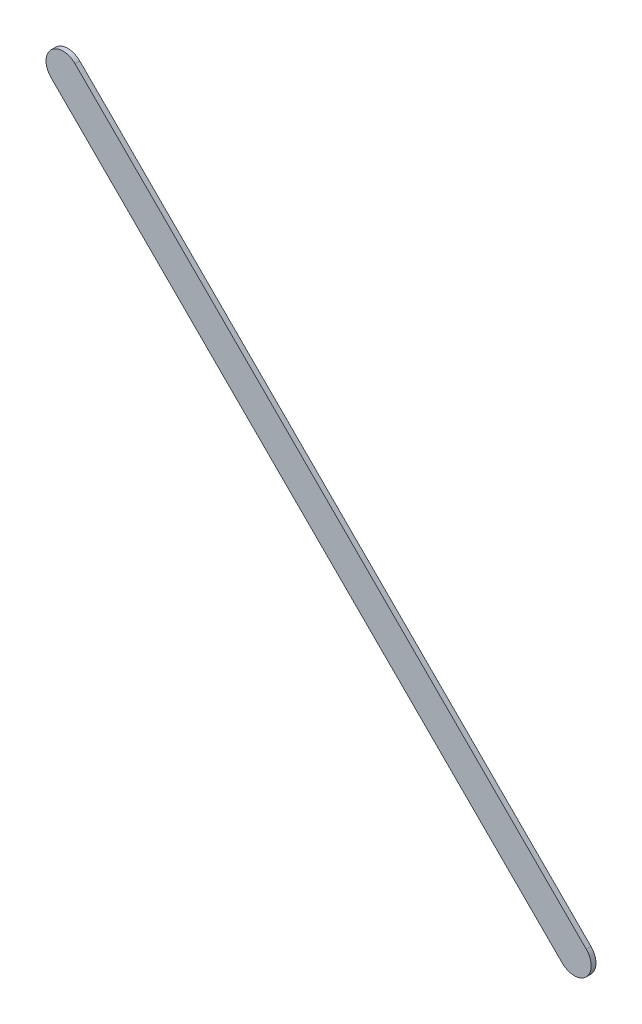
ISO-10303-21;
HEADER;
FILE_DESCRIPTION(('STEP AP214'),'2;1');
FILE_NAME('part.step','',(''),(''),'','','');
FILE_SCHEMA(('AUTOMOTIVE_DESIGN { 1 0 10303 214 1 1 1 1 }'));
ENDSEC;
DATA;
#1=APPLICATION_CONTEXT('core data for automotive mechanical design processes');
#2=APPLICATION_PROTOCOL_DEFINITION('international standard','automotive_design',2000,#1);
#3=PRODUCT_CONTEXT('',#1,'mechanical');
#4=PRODUCT('Part','Part','',(#3));
#5=PRODUCT_RELATED_PRODUCT_CATEGORY('part','',(#4));
#6=PRODUCT_DEFINITION_FORMATION('','',#4);
#7=PRODUCT_DEFINITION_CONTEXT('part definition',#1,'design');
#8=PRODUCT_DEFINITION('design','',#6,#7);
#9=PRODUCT_DEFINITION_SHAPE('','',#8);
#10=(LENGTH_UNIT() NAMED_UNIT(*) SI_UNIT(.MILLI.,.METRE.));
#11=(NAMED_UNIT(*) PLANE_ANGLE_UNIT() SI_UNIT($,.RADIAN.));
#12=(NAMED_UNIT(*) SI_UNIT($,.STERADIAN.) SOLID_ANGLE_UNIT());
#13=UNCERTAINTY_MEASURE_WITH_UNIT(LENGTH_MEASURE(1.E-05),#10,'distance_accuracy_value','');
#14=(GEOMETRIC_REPRESENTATION_CONTEXT(3) GLOBAL_UNCERTAINTY_ASSIGNED_CONTEXT((#13)) GLOBAL_UNIT_ASSIGNED_CONTEXT((#10,
#11,#12)) REPRESENTATION_CONTEXT('',''));
#15=CARTESIAN_POINT('',(0.,0.,0.));
#16=DIRECTION('',(0.,0.,1.));
#17=DIRECTION('',(1.,0.,0.));
#18=AXIS2_PLACEMENT_3D('',#15,#16,#17);
#19=CARTESIAN_POINT('',(88.8012067,97.5231349,0.));
#20=DIRECTION('',(0.707106781186546,0.707106781186549,0.));
#21=DIRECTION('',(0.707106781186549,-0.707106781186546,0.));
#22=AXIS2_PLACEMENT_3D('',#19,#20,#21);
#23=PLANE('',#22);
#24=DIRECTION('',(0.707106781186549,-0.707106781186546,0.));
#25=VECTOR('',#24,1.);
#26=CARTESIAN_POINT('',(88.8012067,97.5231349,0.03556));
#27=LINE('',#26,#25);
#28=CARTESIAN_POINT('',(88.8012067,97.5231349,0.03556));
#29=VERTEX_POINT('',#28);
#30=CARTESIAN_POINT('',(92.6271706,93.697171,0.03556));
#31=VERTEX_POINT('',#30);
#32=EDGE_CURVE('E11',#29,#31,#27,.T.);
#33=ORIENTED_EDGE('',*,*,#32,.F.);
#34=DIRECTION('',(0.,0.,1.));
#35=VECTOR('',#34,1.);
#36=CARTESIAN_POINT('',(88.8012067,97.5231349,0.));
#37=LINE('',#36,#35);
#38=CARTESIAN_POINT('',(88.8012067,97.5231349,0.));
#39=VERTEX_POINT('',#38);
#40=EDGE_CURVE('E24',#39,#29,#37,.T.);
#41=ORIENTED_EDGE('',*,*,#40,.F.);
#42=DIRECTION('',(0.707106781186549,-0.707106781186546,0.));
#43=VECTOR('',#42,1.);
#44=CARTESIAN_POINT('',(88.8012067,97.5231349,0.));
#45=LINE('',#44,#43);
#46=CARTESIAN_POINT('',(92.6271706,93.697171,0.));
#47=VERTEX_POINT('',#46);
#48=EDGE_CURVE('E75',#39,#47,#45,.T.);
#49=ORIENTED_EDGE('',*,*,#48,.T.);
#50=DIRECTION('',(0.,0.,1.));
#51=VECTOR('',#50,1.);
#52=CARTESIAN_POINT('',(92.6271706,93.697171,0.));
#53=LINE('',#52,#51);
#54=EDGE_CURVE('E37',#47,#31,#53,.T.);
#55=ORIENTED_EDGE('',*,*,#54,.T.);
#56=EDGE_LOOP('',(#33,#41,#49,#55));
#57=FACE_BOUND('',#56,.T.);
#58=ADVANCED_FACE('F17',(#57),#23,.F.);
#59=CARTESIAN_POINT('',(92.7169723,93.78697397,0.));
#60=DIRECTION('',(0.,0.,-1.));
#61=DIRECTION('',(-0.707101781156337,-0.707111781181403,0.));
#62=AXIS2_PLACEMENT_3D('',#59,#60,#61);
#63=CYLINDRICAL_SURFACE('',#62,0.126999680092946);
#64=CARTESIAN_POINT('',(92.7169723,93.78697397,0.03556));
#65=DIRECTION('',(0.,0.,1.));
#66=DIRECTION('',(-0.707101781156337,-0.707111781181403,0.));
#67=AXIS2_PLACEMENT_3D('',#64,#65,#66);
#68=CIRCLE('',#67,0.126999680092946);
#69=CARTESIAN_POINT('',(92.806774,93.87677694,0.03556));
#70=VERTEX_POINT('',#69);
#71=EDGE_CURVE('E83',#31,#70,#68,.T.);
#72=ORIENTED_EDGE('',*,*,#71,.F.);
#73=ORIENTED_EDGE('',*,*,#54,.F.);
#74=CARTESIAN_POINT('',(92.7169723,93.78697397,0.));
#75=DIRECTION('',(0.,0.,1.));
#76=DIRECTION('',(-0.707101781156337,-0.707111781181403,0.));
#77=AXIS2_PLACEMENT_3D('',#74,#75,#76);
#78=CIRCLE('',#77,0.126999680092946);
#79=CARTESIAN_POINT('',(92.806774,93.87677694,0.));
#80=VERTEX_POINT('',#79);
#81=EDGE_CURVE('E81',#47,#80,#78,.T.);
#82=ORIENTED_EDGE('',*,*,#81,.T.);
#83=DIRECTION('',(0.,0.,1.));
#84=VECTOR('',#83,1.);
#85=CARTESIAN_POINT('',(92.806774,93.87677694,0.));
#86=LINE('',#85,#84);
#87=EDGE_CURVE('E67',#80,#70,#86,.T.);
#88=ORIENTED_EDGE('',*,*,#87,.T.);
#89=EDGE_LOOP('',(#72,#73,#82,#88));
#90=FACE_BOUND('',#89,.T.);
#91=ADVANCED_FACE('F89',(#90),#63,.T.);
#92=CARTESIAN_POINT('',(92.806774,93.87677694,0.));
#93=DIRECTION('',(-0.707106781186546,-0.707106781186549,0.));
#94=DIRECTION('',(-0.707106781186549,0.707106781186546,0.));
#95=AXIS2_PLACEMENT_3D('',#92,#93,#94);
#96=PLANE('',#95);
#97=DIRECTION('',(-0.707106781186549,0.707106781186546,0.));
#98=VECTOR('',#97,1.);
#99=CARTESIAN_POINT('',(92.806774,93.87677694,0.03556));
#100=LINE('',#99,#98);
#101=CARTESIAN_POINT('',(88.98081264,97.7027383,0.03556));
#102=VERTEX_POINT('',#101);
#103=EDGE_CURVE('E71',#70,#102,#100,.T.);
#104=ORIENTED_EDGE('',*,*,#103,.F.);
#105=ORIENTED_EDGE('',*,*,#87,.F.);
#106=DIRECTION('',(-0.707106781186549,0.707106781186546,0.));
#107=VECTOR('',#106,1.);
#108=CARTESIAN_POINT('',(92.806774,93.87677694,0.));
#109=LINE('',#108,#107);
#110=CARTESIAN_POINT('',(88.98081264,97.7027383,0.));
#111=VERTEX_POINT('',#110);
#112=EDGE_CURVE('E63',#80,#111,#109,.T.);
#113=ORIENTED_EDGE('',*,*,#112,.T.);
#114=DIRECTION('',(0.,0.,1.));
#115=VECTOR('',#114,1.);
#116=CARTESIAN_POINT('',(88.98081264,97.7027383,0.));
#117=LINE('',#116,#115);
#118=EDGE_CURVE('E53',#111,#102,#117,.T.);
#119=ORIENTED_EDGE('',*,*,#118,.T.);
#120=EDGE_LOOP('',(#104,#105,#113,#119));
#121=FACE_BOUND('',#120,.T.);
#122=ADVANCED_FACE('F66',(#121),#96,.F.);
#123=CARTESIAN_POINT('',(88.89100967,97.6129366,0.));
#124=DIRECTION('',(0.,0.,-1.));
#125=DIRECTION('',(0.707111781181459,0.707101781156281,0.));
#126=AXIS2_PLACEMENT_3D('',#123,#124,#125);
#127=CYLINDRICAL_SURFACE('',#126,0.126999680092949);
#128=CARTESIAN_POINT('',(88.89100967,97.6129366,0.03556));
#129=DIRECTION('',(0.,0.,1.));
#130=DIRECTION('',(0.707111781181459,0.707101781156281,0.));
#131=AXIS2_PLACEMENT_3D('',#128,#129,#130);
#132=CIRCLE('',#131,0.126999680092949);
#133=EDGE_CURVE('E59',#102,#29,#132,.T.);
#134=ORIENTED_EDGE('',*,*,#133,.F.);
#135=ORIENTED_EDGE('',*,*,#118,.F.);
#136=CARTESIAN_POINT('',(88.89100967,97.6129366,0.));
#137=DIRECTION('',(0.,0.,1.));
#138=DIRECTION('',(0.707111781181459,0.707101781156281,0.));
#139=AXIS2_PLACEMENT_3D('',#136,#137,#138);
#140=CIRCLE('',#139,0.126999680092949);
#141=EDGE_CURVE('E57',#111,#39,#140,.T.);
#142=ORIENTED_EDGE('',*,*,#141,.T.);
#143=ORIENTED_EDGE('',*,*,#40,.T.);
#144=EDGE_LOOP('',(#134,#135,#142,#143));
#145=FACE_BOUND('',#144,.T.);
#146=ADVANCED_FACE('F55',(#145),#127,.T.);
#147=CARTESIAN_POINT('',(88.8012067,97.5231349,0.));
#148=DIRECTION('',(0.,0.,-1.));
#149=DIRECTION('',(-1.,0.,0.));
#150=AXIS2_PLACEMENT_3D('',#147,#148,#149);
#151=PLANE('',#150);
#152=ORIENTED_EDGE('',*,*,#141,.F.);
#153=ORIENTED_EDGE('',*,*,#112,.F.);
#154=ORIENTED_EDGE('',*,*,#81,.F.);
#155=ORIENTED_EDGE('',*,*,#48,.F.);
#156=EDGE_LOOP('',(#152,#153,#154,#155));
#157=FACE_BOUND('',#156,.T.);
#158=ADVANCED_FACE('F74',(#157),#151,.T.);
#159=CARTESIAN_POINT('',(88.8012067,97.5231349,0.03556));
#160=DIRECTION('',(0.,0.,-1.));
#161=DIRECTION('',(-1.,0.,0.));
#162=AXIS2_PLACEMENT_3D('',#159,#160,#161);
#163=PLANE('',#162);
#164=ORIENTED_EDGE('',*,*,#32,.T.);
#165=ORIENTED_EDGE('',*,*,#71,.T.);
#166=ORIENTED_EDGE('',*,*,#103,.T.);
#167=ORIENTED_EDGE('',*,*,#133,.T.);
#168=EDGE_LOOP('',(#164,#165,#166,#167));
#169=FACE_BOUND('',#168,.T.);
#170=ADVANCED_FACE('F91',(#169),#163,.F.);
#171=CLOSED_SHELL('',(#58,#91,#122,#146,#158,#170));
#172=MANIFOLD_SOLID_BREP('B1',#171);
#173=ADVANCED_BREP_SHAPE_REPRESENTATION('',(#18,#172),#14);
#174=SHAPE_DEFINITION_REPRESENTATION(#9,#173);
ENDSEC;
END-ISO-10303-21;
